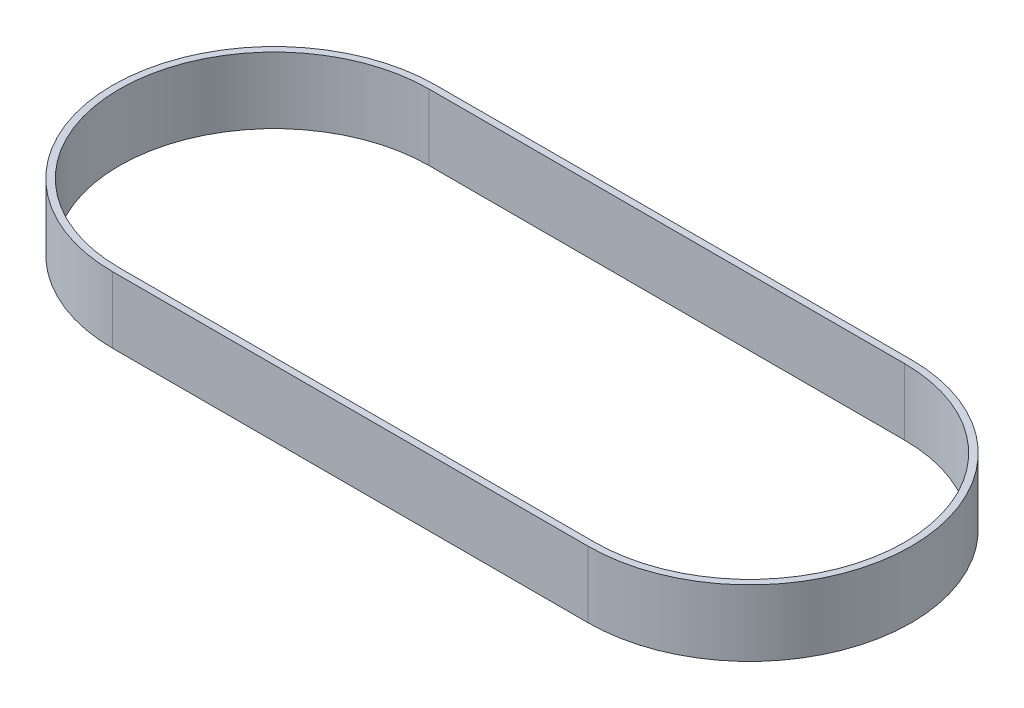
ISO-10303-21;
HEADER;
FILE_DESCRIPTION(('STEP AP214'),'2;1');
FILE_NAME('part.step','',(''),(''),'','','');
FILE_SCHEMA(('AUTOMOTIVE_DESIGN { 1 0 10303 214 1 1 1 1 }'));
ENDSEC;
DATA;
#1=APPLICATION_CONTEXT('core data for automotive mechanical design processes');
#2=APPLICATION_PROTOCOL_DEFINITION('international standard','automotive_design',2000,#1);
#3=PRODUCT_CONTEXT('',#1,'mechanical');
#4=PRODUCT('Part','Part','',(#3));
#5=PRODUCT_RELATED_PRODUCT_CATEGORY('part','',(#4));
#6=PRODUCT_DEFINITION_FORMATION('','',#4);
#7=PRODUCT_DEFINITION_CONTEXT('part definition',#1,'design');
#8=PRODUCT_DEFINITION('design','',#6,#7);
#9=PRODUCT_DEFINITION_SHAPE('','',#8);
#10=(LENGTH_UNIT() NAMED_UNIT(*) SI_UNIT(.MILLI.,.METRE.));
#11=(NAMED_UNIT(*) PLANE_ANGLE_UNIT() SI_UNIT($,.RADIAN.));
#12=(NAMED_UNIT(*) SI_UNIT($,.STERADIAN.) SOLID_ANGLE_UNIT());
#13=UNCERTAINTY_MEASURE_WITH_UNIT(LENGTH_MEASURE(1.E-05),#10,'distance_accuracy_value','');
#14=(GEOMETRIC_REPRESENTATION_CONTEXT(3) GLOBAL_UNCERTAINTY_ASSIGNED_CONTEXT((#13)) GLOBAL_UNIT_ASSIGNED_CONTEXT((#10,
#11,#12)) REPRESENTATION_CONTEXT('',''));
#15=CARTESIAN_POINT('',(0.,0.,0.));
#16=DIRECTION('',(0.,0.,1.));
#17=DIRECTION('',(1.,0.,0.));
#18=AXIS2_PLACEMENT_3D('',#15,#16,#17);
#19=CARTESIAN_POINT('',(0.,15.,35.0139));
#20=DIRECTION('',(0.,0.,-1.));
#21=DIRECTION('',(-1.,0.,0.));
#22=AXIS2_PLACEMENT_3D('',#19,#20,#21);
#23=PLANE('',#22);
#24=DIRECTION('',(1.,0.,0.));
#25=VECTOR('',#24,1.);
#26=CARTESIAN_POINT('',(0.,15.,35.0139));
#27=LINE('',#26,#25);
#28=CARTESIAN_POINT('',(107.5182,15.,35.0139));
#29=VERTEX_POINT('',#28);
#30=CARTESIAN_POINT('',(0.,15.,35.0139));
#31=VERTEX_POINT('',#30);
#32=EDGE_CURVE('E133',#29,#31,#27,.F.);
#33=ORIENTED_EDGE('',*,*,#32,.F.);
#34=DIRECTION('',(0.,-1.,0.));
#35=VECTOR('',#34,1.);
#36=CARTESIAN_POINT('',(107.5182,15.,35.0139));
#37=LINE('',#36,#35);
#38=CARTESIAN_POINT('',(107.5182,0.,35.0139));
#39=VERTEX_POINT('',#38);
#40=EDGE_CURVE('E98',#29,#39,#37,.T.);
#41=ORIENTED_EDGE('',*,*,#40,.T.);
#42=DIRECTION('',(1.,0.,0.));
#43=VECTOR('',#42,1.);
#44=CARTESIAN_POINT('',(0.,0.,35.0139));
#45=LINE('',#44,#43);
#46=CARTESIAN_POINT('',(0.,0.,35.0139));
#47=VERTEX_POINT('',#46);
#48=EDGE_CURVE('E108',#39,#47,#45,.F.);
#49=ORIENTED_EDGE('',*,*,#48,.T.);
#50=DIRECTION('',(0.,-1.,0.));
#51=VECTOR('',#50,1.);
#52=CARTESIAN_POINT('',(0.,15.,35.0139));
#53=LINE('',#52,#51);
#54=EDGE_CURVE('E122',#47,#31,#53,.F.);
#55=ORIENTED_EDGE('',*,*,#54,.T.);
#56=EDGE_LOOP('',(#33,#41,#49,#55));
#57=FACE_BOUND('',#56,.T.);
#58=ADVANCED_FACE('F17',(#57),#23,.T.);
#59=CARTESIAN_POINT('',(0.,15.,0.));
#60=DIRECTION('',(0.,-1.,0.));
#61=DIRECTION('',(0.,0.,-1.));
#62=AXIS2_PLACEMENT_3D('',#59,#60,#61);
#63=CYLINDRICAL_SURFACE('',#62,35.0139);
#64=DIRECTION('',(0.,1.,0.));
#65=VECTOR('',#64,1.);
#66=CARTESIAN_POINT('',(0.,15.,-35.0139));
#67=LINE('',#66,#65);
#68=CARTESIAN_POINT('',(0.,15.,-35.0139));
#69=VERTEX_POINT('',#68);
#70=CARTESIAN_POINT('',(0.,0.,-35.0139));
#71=VERTEX_POINT('',#70);
#72=EDGE_CURVE('E119',#69,#71,#67,.F.);
#73=ORIENTED_EDGE('',*,*,#72,.F.);
#74=CARTESIAN_POINT('',(0.,15.,0.));
#75=DIRECTION('',(0.,-1.,0.));
#76=DIRECTION('',(0.,0.,-1.));
#77=AXIS2_PLACEMENT_3D('',#74,#75,#76);
#78=CIRCLE('',#77,35.0139);
#79=EDGE_CURVE('E130',#31,#69,#78,.T.);
#80=ORIENTED_EDGE('',*,*,#79,.F.);
#81=ORIENTED_EDGE('',*,*,#54,.F.);
#82=CARTESIAN_POINT('',(0.,0.,0.));
#83=DIRECTION('',(0.,-1.,0.));
#84=DIRECTION('',(0.,0.,-1.));
#85=AXIS2_PLACEMENT_3D('',#82,#83,#84);
#86=CIRCLE('',#85,35.0139);
#87=EDGE_CURVE('E89',#47,#71,#86,.T.);
#88=ORIENTED_EDGE('',*,*,#87,.T.);
#89=EDGE_LOOP('',(#73,#80,#81,#88));
#90=FACE_BOUND('',#89,.T.);
#91=ADVANCED_FACE('F151',(#90),#63,.F.);
#92=CARTESIAN_POINT('',(0.,15.,-35.0139));
#93=DIRECTION('',(0.,0.,1.));
#94=DIRECTION('',(1.,0.,0.));
#95=AXIS2_PLACEMENT_3D('',#92,#93,#94);
#96=PLANE('',#95);
#97=DIRECTION('',(1.,0.,0.));
#98=VECTOR('',#97,1.);
#99=CARTESIAN_POINT('',(0.,15.,-35.0139));
#100=LINE('',#99,#98);
#101=CARTESIAN_POINT('',(107.5182,15.,-35.0139));
#102=VERTEX_POINT('',#101);
#103=EDGE_CURVE('E129',#69,#102,#100,.T.);
#104=ORIENTED_EDGE('',*,*,#103,.F.);
#105=ORIENTED_EDGE('',*,*,#72,.T.);
#106=DIRECTION('',(1.,0.,0.));
#107=VECTOR('',#106,1.);
#108=CARTESIAN_POINT('',(0.,0.,-35.0139));
#109=LINE('',#108,#107);
#110=CARTESIAN_POINT('',(107.5182,0.,-35.0139));
#111=VERTEX_POINT('',#110);
#112=EDGE_CURVE('E97',#71,#111,#109,.T.);
#113=ORIENTED_EDGE('',*,*,#112,.T.);
#114=DIRECTION('',(0.,-1.,0.));
#115=VECTOR('',#114,1.);
#116=CARTESIAN_POINT('',(107.5182,15.,-35.0139));
#117=LINE('',#116,#115);
#118=EDGE_CURVE('E117',#111,#102,#117,.F.);
#119=ORIENTED_EDGE('',*,*,#118,.T.);
#120=EDGE_LOOP('',(#104,#105,#113,#119));
#121=FACE_BOUND('',#120,.T.);
#122=ADVANCED_FACE('F221',(#121),#96,.T.);
#123=CARTESIAN_POINT('',(107.5182,15.,0.));
#124=DIRECTION('',(0.,-1.,0.));
#125=DIRECTION('',(0.,0.,-1.));
#126=AXIS2_PLACEMENT_3D('',#123,#124,#125);
#127=CYLINDRICAL_SURFACE('',#126,35.0139);
#128=ORIENTED_EDGE('',*,*,#40,.F.);
#129=CARTESIAN_POINT('',(107.5182,15.,0.));
#130=DIRECTION('',(0.,-1.,0.));
#131=DIRECTION('',(0.,0.,-1.));
#132=AXIS2_PLACEMENT_3D('',#129,#130,#131);
#133=CIRCLE('',#132,35.0139);
#134=EDGE_CURVE('E116',#102,#29,#133,.T.);
#135=ORIENTED_EDGE('',*,*,#134,.F.);
#136=ORIENTED_EDGE('',*,*,#118,.F.);
#137=CARTESIAN_POINT('',(107.5182,0.,0.));
#138=DIRECTION('',(0.,-1.,0.));
#139=DIRECTION('',(0.,0.,-1.));
#140=AXIS2_PLACEMENT_3D('',#137,#138,#139);
#141=CIRCLE('',#140,35.0139);
#142=EDGE_CURVE('E110',#111,#39,#141,.T.);
#143=ORIENTED_EDGE('',*,*,#142,.T.);
#144=EDGE_LOOP('',(#128,#135,#136,#143));
#145=FACE_BOUND('',#144,.T.);
#146=ADVANCED_FACE('F142',(#145),#127,.F.);
#147=CARTESIAN_POINT('',(107.5182,15.,0.));
#148=DIRECTION('',(0.,-1.,0.));
#149=DIRECTION('',(0.,0.,-1.));
#150=AXIS2_PLACEMENT_3D('',#147,#148,#149);
#151=CYLINDRICAL_SURFACE('',#150,36.5379);
#152=CARTESIAN_POINT('',(107.5182,15.,0.));
#153=DIRECTION('',(0.,-1.,0.));
#154=DIRECTION('',(0.,0.,-1.));
#155=AXIS2_PLACEMENT_3D('',#152,#153,#154);
#156=CIRCLE('',#155,36.5379);
#157=CARTESIAN_POINT('',(107.5182,15.,36.5379));
#158=VERTEX_POINT('',#157);
#159=CARTESIAN_POINT('',(107.5182,15.,-36.5379));
#160=VERTEX_POINT('',#159);
#161=EDGE_CURVE('E84',#158,#160,#156,.F.);
#162=ORIENTED_EDGE('',*,*,#161,.F.);
#163=DIRECTION('',(0.,1.,0.));
#164=VECTOR('',#163,1.);
#165=CARTESIAN_POINT('',(107.5182,15.,36.5379));
#166=LINE('',#165,#164);
#167=CARTESIAN_POINT('',(107.5182,0.,36.5379));
#168=VERTEX_POINT('',#167);
#169=EDGE_CURVE('E80',#158,#168,#166,.F.);
#170=ORIENTED_EDGE('',*,*,#169,.T.);
#171=CARTESIAN_POINT('',(107.5182,0.,0.));
#172=DIRECTION('',(0.,-1.,0.));
#173=DIRECTION('',(0.,0.,-1.));
#174=AXIS2_PLACEMENT_3D('',#171,#172,#173);
#175=CIRCLE('',#174,36.5379);
#176=CARTESIAN_POINT('',(107.5182,0.,-36.5379));
#177=VERTEX_POINT('',#176);
#178=EDGE_CURVE('E20',#168,#177,#175,.F.);
#179=ORIENTED_EDGE('',*,*,#178,.T.);
#180=DIRECTION('',(0.,1.,0.));
#181=VECTOR('',#180,1.);
#182=CARTESIAN_POINT('',(107.5182,15.,-36.5379));
#183=LINE('',#182,#181);
#184=EDGE_CURVE('E114',#177,#160,#183,.T.);
#185=ORIENTED_EDGE('',*,*,#184,.T.);
#186=EDGE_LOOP('',(#162,#170,#179,#185));
#187=FACE_BOUND('',#186,.T.);
#188=ADVANCED_FACE('F82',(#187),#151,.T.);
#189=CARTESIAN_POINT('',(0.,0.,0.));
#190=DIRECTION('',(0.,1.,0.));
#191=DIRECTION('',(0.,0.,1.));
#192=AXIS2_PLACEMENT_3D('',#189,#190,#191);
#193=PLANE('',#192);
#194=ORIENTED_EDGE('',*,*,#48,.F.);
#195=ORIENTED_EDGE('',*,*,#142,.F.);
#196=ORIENTED_EDGE('',*,*,#112,.F.);
#197=ORIENTED_EDGE('',*,*,#87,.F.);
#198=EDGE_LOOP('',(#194,#195,#196,#197));
#199=FACE_BOUND('',#198,.T.);
#200=DIRECTION('',(1.,0.,0.));
#201=VECTOR('',#200,1.);
#202=CARTESIAN_POINT('',(0.,0.,-36.5379));
#203=LINE('',#202,#201);
#204=CARTESIAN_POINT('',(0.,0.,-36.5379));
#205=VERTEX_POINT('',#204);
#206=EDGE_CURVE('E95',#205,#177,#203,.T.);
#207=ORIENTED_EDGE('',*,*,#206,.T.);
#208=ORIENTED_EDGE('',*,*,#178,.F.);
#209=DIRECTION('',(-1.,0.,0.));
#210=VECTOR('',#209,1.);
#211=CARTESIAN_POINT('',(0.,0.,36.5379));
#212=LINE('',#211,#210);
#213=CARTESIAN_POINT('',(0.,0.,36.5379));
#214=VERTEX_POINT('',#213);
#215=EDGE_CURVE('E88',#168,#214,#212,.T.);
#216=ORIENTED_EDGE('',*,*,#215,.T.);
#217=CARTESIAN_POINT('',(0.,0.,0.));
#218=DIRECTION('',(0.,-1.,0.));
#219=DIRECTION('',(0.,0.,-1.));
#220=AXIS2_PLACEMENT_3D('',#217,#218,#219);
#221=CIRCLE('',#220,36.5379);
#222=EDGE_CURVE('E113',#205,#214,#221,.F.);
#223=ORIENTED_EDGE('',*,*,#222,.F.);
#224=EDGE_LOOP('',(#207,#208,#216,#223));
#225=FACE_BOUND('',#224,.T.);
#226=ADVANCED_FACE('F92',(#199,#225),#193,.F.);
#227=CARTESIAN_POINT('',(0.,15.,36.5379));
#228=DIRECTION('',(0.,0.,-1.));
#229=DIRECTION('',(-1.,0.,0.));
#230=AXIS2_PLACEMENT_3D('',#227,#228,#229);
#231=PLANE('',#230);
#232=ORIENTED_EDGE('',*,*,#169,.F.);
#233=DIRECTION('',(1.,0.,0.));
#234=VECTOR('',#233,1.);
#235=CARTESIAN_POINT('',(0.,15.,36.5379));
#236=LINE('',#235,#234);
#237=CARTESIAN_POINT('',(0.,15.,36.5379));
#238=VERTEX_POINT('',#237);
#239=EDGE_CURVE('E103',#238,#158,#236,.T.);
#240=ORIENTED_EDGE('',*,*,#239,.F.);
#241=DIRECTION('',(0.,-1.,0.));
#242=VECTOR('',#241,1.);
#243=CARTESIAN_POINT('',(0.,15.,36.5379));
#244=LINE('',#243,#242);
#245=EDGE_CURVE('E101',#214,#238,#244,.F.);
#246=ORIENTED_EDGE('',*,*,#245,.F.);
#247=ORIENTED_EDGE('',*,*,#215,.F.);
#248=EDGE_LOOP('',(#232,#240,#246,#247));
#249=FACE_BOUND('',#248,.T.);
#250=ADVANCED_FACE('F99',(#249),#231,.F.);
#251=CARTESIAN_POINT('',(0.,15.,0.));
#252=DIRECTION('',(0.,1.,0.));
#253=DIRECTION('',(0.,0.,1.));
#254=AXIS2_PLACEMENT_3D('',#251,#252,#253);
#255=PLANE('',#254);
#256=ORIENTED_EDGE('',*,*,#103,.T.);
#257=ORIENTED_EDGE('',*,*,#134,.T.);
#258=ORIENTED_EDGE('',*,*,#32,.T.);
#259=ORIENTED_EDGE('',*,*,#79,.T.);
#260=EDGE_LOOP('',(#256,#257,#258,#259));
#261=FACE_BOUND('',#260,.T.);
#262=ORIENTED_EDGE('',*,*,#161,.T.);
#263=DIRECTION('',(1.,0.,0.));
#264=VECTOR('',#263,1.);
#265=CARTESIAN_POINT('',(0.,15.,-36.5379));
#266=LINE('',#265,#264);
#267=CARTESIAN_POINT('',(0.,15.,-36.5379));
#268=VERTEX_POINT('',#267);
#269=EDGE_CURVE('E35',#160,#268,#266,.F.);
#270=ORIENTED_EDGE('',*,*,#269,.T.);
#271=CARTESIAN_POINT('',(0.,15.,0.));
#272=DIRECTION('',(0.,-1.,0.));
#273=DIRECTION('',(0.,0.,-1.));
#274=AXIS2_PLACEMENT_3D('',#271,#272,#273);
#275=CIRCLE('',#274,36.5379);
#276=EDGE_CURVE('E26',#238,#268,#275,.T.);
#277=ORIENTED_EDGE('',*,*,#276,.F.);
#278=ORIENTED_EDGE('',*,*,#239,.T.);
#279=EDGE_LOOP('',(#262,#270,#277,#278));
#280=FACE_BOUND('',#279,.T.);
#281=ADVANCED_FACE('F156',(#261,#280),#255,.T.);
#282=CARTESIAN_POINT('',(0.,15.,-36.5379));
#283=DIRECTION('',(0.,0.,1.));
#284=DIRECTION('',(1.,0.,0.));
#285=AXIS2_PLACEMENT_3D('',#282,#283,#284);
#286=PLANE('',#285);
#287=DIRECTION('',(0.,-1.,0.));
#288=VECTOR('',#287,1.);
#289=CARTESIAN_POINT('',(0.,15.,-36.5379));
#290=LINE('',#289,#288);
#291=EDGE_CURVE('E11',#268,#205,#290,.T.);
#292=ORIENTED_EDGE('',*,*,#291,.F.);
#293=ORIENTED_EDGE('',*,*,#269,.F.);
#294=ORIENTED_EDGE('',*,*,#184,.F.);
#295=ORIENTED_EDGE('',*,*,#206,.F.);
#296=EDGE_LOOP('',(#292,#293,#294,#295));
#297=FACE_BOUND('',#296,.T.);
#298=ADVANCED_FACE('F163',(#297),#286,.F.);
#299=CARTESIAN_POINT('',(0.,15.,0.));
#300=DIRECTION('',(0.,-1.,0.));
#301=DIRECTION('',(0.,0.,-1.));
#302=AXIS2_PLACEMENT_3D('',#299,#300,#301);
#303=CYLINDRICAL_SURFACE('',#302,36.5379);
#304=ORIENTED_EDGE('',*,*,#276,.T.);
#305=ORIENTED_EDGE('',*,*,#291,.T.);
#306=ORIENTED_EDGE('',*,*,#222,.T.);
#307=ORIENTED_EDGE('',*,*,#245,.T.);
#308=EDGE_LOOP('',(#304,#305,#306,#307));
#309=FACE_BOUND('',#308,.T.);
#310=ADVANCED_FACE('F161',(#309),#303,.T.);
#311=CLOSED_SHELL('',(#58,#91,#122,#146,#188,#226,#250,#281,#298,#310));
#312=MANIFOLD_SOLID_BREP('B1',#311);
#313=ADVANCED_BREP_SHAPE_REPRESENTATION('',(#18,#312),#14);
#314=SHAPE_DEFINITION_REPRESENTATION(#9,#313);
ENDSEC;
END-ISO-10303-21;
